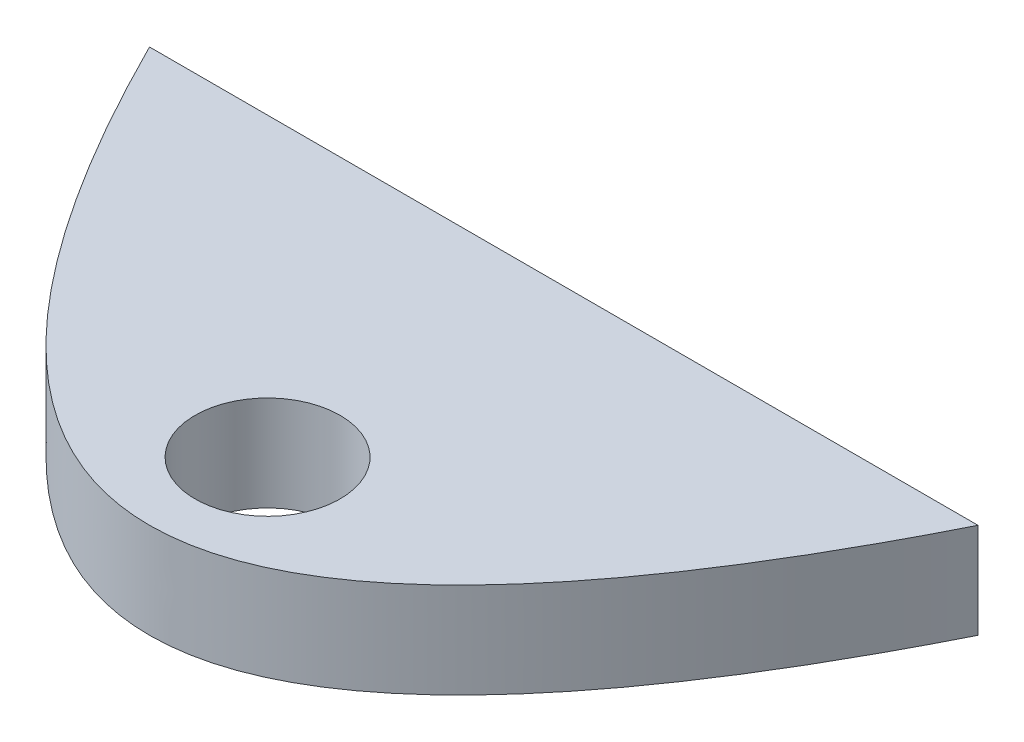
ISO-10303-21;
HEADER;
FILE_DESCRIPTION(('STEP AP214'),'2;1');
FILE_NAME('part.step','',(''),(''),'','','');
FILE_SCHEMA(('AUTOMOTIVE_DESIGN { 1 0 10303 214 1 1 1 1 }'));
ENDSEC;
DATA;
#1=APPLICATION_CONTEXT('core data for automotive mechanical design processes');
#2=APPLICATION_PROTOCOL_DEFINITION('international standard','automotive_design',2000,#1);
#3=PRODUCT_CONTEXT('',#1,'mechanical');
#4=PRODUCT('Part','Part','',(#3));
#5=PRODUCT_RELATED_PRODUCT_CATEGORY('part','',(#4));
#6=PRODUCT_DEFINITION_FORMATION('','',#4);
#7=PRODUCT_DEFINITION_CONTEXT('part definition',#1,'design');
#8=PRODUCT_DEFINITION('design','',#6,#7);
#9=PRODUCT_DEFINITION_SHAPE('','',#8);
#10=(LENGTH_UNIT() NAMED_UNIT(*) SI_UNIT(.MILLI.,.METRE.));
#11=(NAMED_UNIT(*) PLANE_ANGLE_UNIT() SI_UNIT($,.RADIAN.));
#12=(NAMED_UNIT(*) SI_UNIT($,.STERADIAN.) SOLID_ANGLE_UNIT());
#13=UNCERTAINTY_MEASURE_WITH_UNIT(LENGTH_MEASURE(1.E-05),#10,'distance_accuracy_value','');
#14=(GEOMETRIC_REPRESENTATION_CONTEXT(3) GLOBAL_UNCERTAINTY_ASSIGNED_CONTEXT((#13)) GLOBAL_UNIT_ASSIGNED_CONTEXT((#10,
#11,#12)) REPRESENTATION_CONTEXT('',''));
#15=CARTESIAN_POINT('',(0.,0.,0.));
#16=DIRECTION('',(0.,0.,1.));
#17=DIRECTION('',(1.,0.,0.));
#18=AXIS2_PLACEMENT_3D('',#15,#16,#17);
#19=CARTESIAN_POINT('',(-200.000000000337,300.,-6.70196537155832E-10));
#20=CARTESIAN_POINT('',(-5.91540705308091E-11,300.,400.000000000552));
#21=CARTESIAN_POINT('',(200.000000000219,300.,-4.34305369445553E-10));
#22=B_SPLINE_CURVE_WITH_KNOTS('',2,(#19,#20,#21),.UNSPECIFIED.,.F.,.F.,(3,3),(0.056028396232078,
0.943971603767659),.UNSPECIFIED.);
#23=DIRECTION('',(0.,-1.,0.));
#24=VECTOR('',#23,1.);
#25=SURFACE_OF_LINEAR_EXTRUSION('',#22,#24);
#26=DIRECTION('',(0.,-1.,0.));
#27=VECTOR('',#26,1.);
#28=CARTESIAN_POINT('',(200.000000000156,300.,-5.35238059385865E-10));
#29=LINE('',#28,#27);
#30=CARTESIAN_POINT('',(200.000000000156,46.,-5.35238059385865E-10));
#31=VERTEX_POINT('',#30);
#32=CARTESIAN_POINT('',(200.000000000156,0.,-5.35238059385865E-10));
#33=VERTEX_POINT('',#32);
#34=EDGE_CURVE('E11',#31,#33,#29,.T.);
#35=ORIENTED_EDGE('',*,*,#34,.F.);
#36=CARTESIAN_POINT('',(-200.000000000337,46.,-6.70196537155832E-10));
#37=CARTESIAN_POINT('',(-5.91540705308091E-11,46.,400.000000000552));
#38=CARTESIAN_POINT('',(200.000000000219,46.,-4.34305369445553E-10));
#39=B_SPLINE_CURVE_WITH_KNOTS('',2,(#36,#37,#38),.UNSPECIFIED.,.F.,.F.,(3,3),(0.056028396232078,
0.943971603767659),.UNSPECIFIED.);
#40=CARTESIAN_POINT('',(-200.00000000027,46.,0.));
#41=VERTEX_POINT('',#40);
#42=EDGE_CURVE('E51',#31,#41,#39,.F.);
#43=ORIENTED_EDGE('',*,*,#42,.T.);
#44=DIRECTION('',(0.,-1.,0.));
#45=VECTOR('',#44,1.);
#46=CARTESIAN_POINT('',(-200.00000000027,300.,-5.35238059385865E-10));
#47=LINE('',#46,#45);
#48=CARTESIAN_POINT('',(-200.00000000027,0.,-5.35238059385865E-10));
#49=VERTEX_POINT('',#48);
#50=EDGE_CURVE('E44',#41,#49,#47,.T.);
#51=ORIENTED_EDGE('',*,*,#50,.T.);
#52=CARTESIAN_POINT('',(-200.000000000337,0.,-6.70196537155832E-10));
#53=CARTESIAN_POINT('',(-5.91540705308091E-11,0.,400.000000000552));
#54=CARTESIAN_POINT('',(200.000000000219,0.,-4.34305369445553E-10));
#55=B_SPLINE_CURVE_WITH_KNOTS('',2,(#52,#53,#54),.UNSPECIFIED.,.F.,.F.,(3,3),(0.056028396232078,
0.943971603767659),.UNSPECIFIED.);
#56=EDGE_CURVE('E74',#49,#33,#55,.T.);
#57=ORIENTED_EDGE('',*,*,#56,.T.);
#58=EDGE_LOOP('',(#35,#43,#51,#57));
#59=FACE_BOUND('',#58,.T.);
#60=ADVANCED_FACE('F35',(#59),#25,.F.);
#61=CARTESIAN_POINT('',(-200.00000000027,300.,-5.35238059385865E-10));
#62=DIRECTION('',(0.,0.,1.));
#63=DIRECTION('',(1.,0.,0.));
#64=AXIS2_PLACEMENT_3D('',#61,#62,#63);
#65=PLANE('',#64);
#66=ORIENTED_EDGE('',*,*,#50,.F.);
#67=DIRECTION('',(-1.,0.,0.));
#68=VECTOR('',#67,1.);
#69=CARTESIAN_POINT('',(280.52836034843,46.,0.));
#70=LINE('',#69,#68);
#71=EDGE_CURVE('E65',#31,#41,#70,.T.);
#72=ORIENTED_EDGE('',*,*,#71,.F.);
#73=ORIENTED_EDGE('',*,*,#34,.T.);
#74=DIRECTION('',(-1.,0.,0.));
#75=VECTOR('',#74,1.);
#76=CARTESIAN_POINT('',(-200.00000000027,0.,-5.35238059385865E-10));
#77=LINE('',#76,#75);
#78=EDGE_CURVE('E71',#33,#49,#77,.T.);
#79=ORIENTED_EDGE('',*,*,#78,.T.);
#80=EDGE_LOOP('',(#66,#72,#73,#79));
#81=FACE_BOUND('',#80,.T.);
#82=ADVANCED_FACE('F69',(#81),#65,.F.);
#83=CARTESIAN_POINT('',(-5.9161009424713E-11,0.,200.));
#84=DIRECTION('',(0.,-1.,0.));
#85=DIRECTION('',(0.,0.,-1.));
#86=AXIS2_PLACEMENT_3D('',#83,#84,#85);
#87=PLANE('',#86);
#88=CARTESIAN_POINT('',(0.,0.,142.999999999465));
#89=DIRECTION('',(0.,-1.,0.));
#90=DIRECTION('',(0.,0.,-1.));
#91=AXIS2_PLACEMENT_3D('',#88,#89,#90);
#92=CIRCLE('',#91,35.);
#93=CARTESIAN_POINT('',(0.,0.,107.999999999465));
#94=VERTEX_POINT('',#93);
#95=EDGE_CURVE('E63',#94,#94,#92,.T.);
#96=ORIENTED_EDGE('',*,*,#95,.F.);
#97=EDGE_LOOP('',(#96));
#98=FACE_BOUND('',#97,.T.);
#99=ORIENTED_EDGE('',*,*,#56,.F.);
#100=ORIENTED_EDGE('',*,*,#78,.F.);
#101=EDGE_LOOP('',(#99,#100));
#102=FACE_BOUND('',#101,.T.);
#103=ADVANCED_FACE('F97',(#98,#102),#87,.T.);
#104=CARTESIAN_POINT('',(0.,-173.,142.999999999465));
#105=DIRECTION('',(0.,1.,0.));
#106=DIRECTION('',(0.,0.,1.));
#107=AXIS2_PLACEMENT_3D('',#104,#105,#106);
#108=CYLINDRICAL_SURFACE('',#107,35.);
#109=CARTESIAN_POINT('',(0.,46.,142.999999999465));
#110=DIRECTION('',(0.,-1.,0.));
#111=DIRECTION('',(0.,0.,-1.));
#112=AXIS2_PLACEMENT_3D('',#109,#110,#111);
#113=CIRCLE('',#112,35.);
#114=CARTESIAN_POINT('',(0.,46.,107.999999999465));
#115=VERTEX_POINT('',#114);
#116=EDGE_CURVE('E39',#115,#115,#113,.F.);
#117=ORIENTED_EDGE('',*,*,#116,.T.);
#118=EDGE_LOOP('',(#117));
#119=FACE_BOUND('',#118,.T.);
#120=ORIENTED_EDGE('',*,*,#95,.T.);
#121=EDGE_LOOP('',(#120));
#122=FACE_BOUND('',#121,.T.);
#123=ADVANCED_FACE('F99',(#119,#122),#108,.F.);
#124=CARTESIAN_POINT('',(280.52836034843,46.,200.000000000059));
#125=DIRECTION('',(0.,-1.,0.));
#126=DIRECTION('',(0.,0.,-1.));
#127=AXIS2_PLACEMENT_3D('',#124,#125,#126);
#128=PLANE('',#127);
#129=ORIENTED_EDGE('',*,*,#116,.F.);
#130=EDGE_LOOP('',(#129));
#131=FACE_BOUND('',#130,.T.);
#132=ORIENTED_EDGE('',*,*,#71,.T.);
#133=ORIENTED_EDGE('',*,*,#42,.F.);
#134=EDGE_LOOP('',(#132,#133));
#135=FACE_BOUND('',#134,.T.);
#136=ADVANCED_FACE('F66',(#131,#135),#128,.F.);
#137=CLOSED_SHELL('',(#60,#82,#103,#123,#136));
#138=MANIFOLD_SOLID_BREP('B2',#137);
#139=ADVANCED_BREP_SHAPE_REPRESENTATION('',(#18,#138),#14);
#140=SHAPE_DEFINITION_REPRESENTATION(#9,#139);
ENDSEC;
END-ISO-10303-21;
